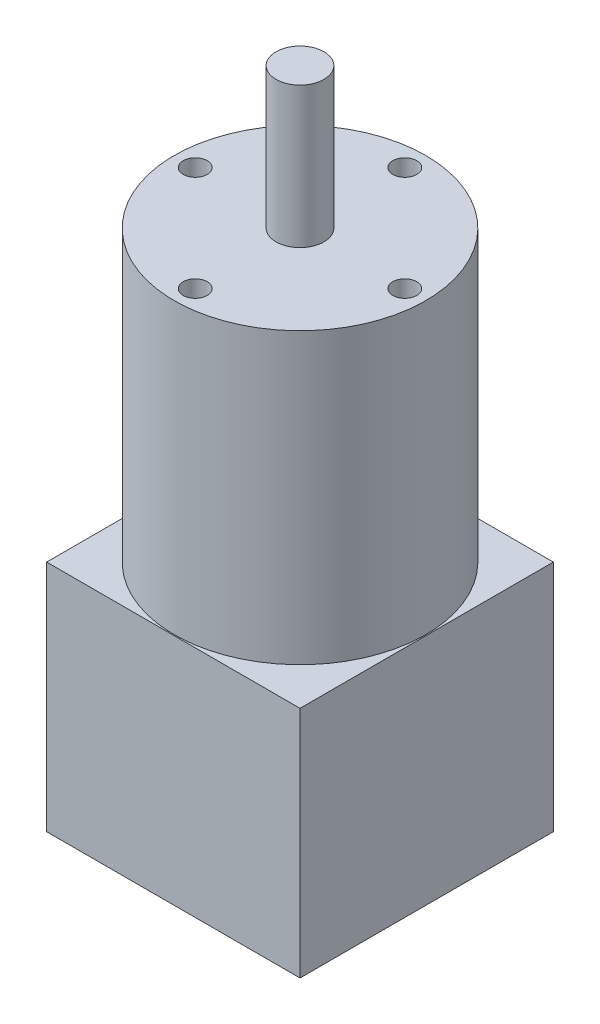
ISO-10303-21;
HEADER;
FILE_DESCRIPTION(('STEP AP214'),'2;1');
FILE_NAME('part.step','',(''),(''),'','','');
FILE_SCHEMA(('AUTOMOTIVE_DESIGN { 1 0 10303 214 1 1 1 1 }'));
ENDSEC;
DATA;
#1=APPLICATION_CONTEXT('core data for automotive mechanical design processes');
#2=APPLICATION_PROTOCOL_DEFINITION('international standard','automotive_design',2000,#1);
#3=PRODUCT_CONTEXT('',#1,'mechanical');
#4=PRODUCT('Part','Part','',(#3));
#5=PRODUCT_RELATED_PRODUCT_CATEGORY('part','',(#4));
#6=PRODUCT_DEFINITION_FORMATION('','',#4);
#7=PRODUCT_DEFINITION_CONTEXT('part definition',#1,'design');
#8=PRODUCT_DEFINITION('design','',#6,#7);
#9=PRODUCT_DEFINITION_SHAPE('','',#8);
#10=(LENGTH_UNIT() NAMED_UNIT(*) SI_UNIT(.MILLI.,.METRE.));
#11=(NAMED_UNIT(*) PLANE_ANGLE_UNIT() SI_UNIT($,.RADIAN.));
#12=(NAMED_UNIT(*) SI_UNIT($,.STERADIAN.) SOLID_ANGLE_UNIT());
#13=UNCERTAINTY_MEASURE_WITH_UNIT(LENGTH_MEASURE(1.E-05),#10,'distance_accuracy_value','');
#14=(GEOMETRIC_REPRESENTATION_CONTEXT(3) GLOBAL_UNCERTAINTY_ASSIGNED_CONTEXT((#13)) GLOBAL_UNIT_ASSIGNED_CONTEXT((#10,
#11,#12)) REPRESENTATION_CONTEXT('',''));
#15=CARTESIAN_POINT('',(0.,0.,0.));
#16=DIRECTION('',(0.,0.,1.));
#17=DIRECTION('',(1.,0.,0.));
#18=AXIS2_PLACEMENT_3D('',#15,#16,#17);
#19=CARTESIAN_POINT('',(0.,110.8,0.));
#20=DIRECTION('',(0.,-1.,0.));
#21=DIRECTION('',(0.,0.,-1.));
#22=AXIS2_PLACEMENT_3D('',#19,#20,#21);
#23=CYLINDRICAL_SURFACE('',#22,4.);
#24=CARTESIAN_POINT('',(0.,87.3,0.));
#25=DIRECTION('',(0.,1.,0.));
#26=DIRECTION('',(0.,0.,1.));
#27=AXIS2_PLACEMENT_3D('',#24,#25,#26);
#28=CIRCLE('',#27,4.);
#29=CARTESIAN_POINT('',(0.,87.3,4.));
#30=VERTEX_POINT('',#29);
#31=EDGE_CURVE('E142',#30,#30,#28,.T.);
#32=ORIENTED_EDGE('',*,*,#31,.T.);
#33=EDGE_LOOP('',(#32));
#34=FACE_BOUND('',#33,.T.);
#35=CARTESIAN_POINT('',(0.,110.8,0.));
#36=DIRECTION('',(0.,1.,0.));
#37=DIRECTION('',(0.,0.,1.));
#38=AXIS2_PLACEMENT_3D('',#35,#36,#37);
#39=CIRCLE('',#38,4.);
#40=CARTESIAN_POINT('',(0.,110.8,4.));
#41=VERTEX_POINT('',#40);
#42=EDGE_CURVE('E254',#41,#41,#39,.T.);
#43=ORIENTED_EDGE('',*,*,#42,.F.);
#44=EDGE_LOOP('',(#43));
#45=FACE_BOUND('',#44,.T.);
#46=DIRECTION('',(0.,-1.,0.));
#47=VECTOR('',#46,1.);
#48=CARTESIAN_POINT('',(-1.5,110.8,-3.70809924354783));
#49=LINE('',#48,#47);
#50=CARTESIAN_POINT('',(-1.5,106.7,-3.70809924354783));
#51=VERTEX_POINT('',#50);
#52=CARTESIAN_POINT('',(-1.5,95.7,-3.70809924354783));
#53=VERTEX_POINT('',#52);
#54=EDGE_CURVE('E148',#51,#53,#49,.T.);
#55=ORIENTED_EDGE('',*,*,#54,.T.);
#56=CARTESIAN_POINT('',(-1.5,95.7,-3.70809924354783));
#57=CARTESIAN_POINT('',(-1.50000149763685,95.6594059305553,-3.70809443488223));
#58=CARTESIAN_POINT('',(-1.49835105709717,95.6188329978994,-3.70876668409976));
#59=CARTESIAN_POINT('',(-1.49177843163966,95.5380093568391,-3.71141698257091));
#60=CARTESIAN_POINT('',(-1.48685734569824,95.4977585447944,-3.71339459320577));
#61=CARTESIAN_POINT('',(-1.4672933482067,95.378226826317,-3.72119033682707));
#62=CARTESIAN_POINT('',(-1.44784901310297,95.2997974497691,-3.72887225208868));
#63=CARTESIAN_POINT('',(-1.39690282812453,95.1476339471668,-3.74825199333564));
#64=CARTESIAN_POINT('',(-1.36541091184269,95.0738960111434,-3.75994650999366));
#65=CARTESIAN_POINT('',(-1.29134257885079,94.9326690628724,-3.7860233337759));
#66=CARTESIAN_POINT('',(-1.24875666733342,94.8651854708132,-3.80040794022651));
#67=CARTESIAN_POINT('',(-1.15146673631305,94.7351088724607,-3.83103570457934));
#68=CARTESIAN_POINT('',(-1.0963044481655,94.6728715264412,-3.84733331324471));
#69=CARTESIAN_POINT('',(-0.976395613097517,94.5582775205832,-3.87949750401636));
#70=CARTESIAN_POINT('',(-0.911646994469719,94.505923002106,-3.89536399207354));
#71=CARTESIAN_POINT('',(-0.771671110191602,94.4108435774906,-3.92553400925355));
#72=CARTESIAN_POINT('',(-0.696160035999181,94.3685118052143,-3.93976501267995));
#73=CARTESIAN_POINT('',(-0.538489868027633,94.2973265968158,-3.9643883038365));
#74=CARTESIAN_POINT('',(-0.456337903183924,94.2684589267464,-3.97478464304361));
#75=CARTESIAN_POINT('',(-0.311568360413163,94.2313833692295,-3.98831063781509));
#76=CARTESIAN_POINT('',(-0.249946259701632,94.2196498632232,-3.9926612104967));
#77=CARTESIAN_POINT('',(-0.125564806183786,94.2039443418765,-3.99852089820637));
#78=CARTESIAN_POINT('',(-0.062804988216711,94.1999755768709,-4.00002882328734));
#79=CARTESIAN_POINT('',(0.,94.2,-4.));
#80=B_SPLINE_CURVE_WITH_KNOTS('',3,(#56,#57,#58,#59,#60,#61,#62,#63,#64,#65,#66,#67,#68,#69,#70,
#71,#72,#73,#74,#75,#76,#77,#78,#79),.UNSPECIFIED.,.F.,.F.,(4,2,2,2,2,2,2,2,2,2,2,4),(0.,
0.121702070650527,0.243363268593937,0.485593089370354,0.727623613350272,0.969861963846899,
1.22297737762719,1.47614757238601,1.73802530937246,1.9996255640306,2.18773738057225,
2.37592792422954),.UNSPECIFIED.);
#81=CARTESIAN_POINT('',(0.,94.2,-4.));
#82=VERTEX_POINT('',#81);
#83=EDGE_CURVE('E59',#53,#82,#80,.T.);
#84=ORIENTED_EDGE('',*,*,#83,.T.);
#85=CARTESIAN_POINT('',(0.,94.2,-4.));
#86=CARTESIAN_POINT('',(0.0406958829842187,94.1999987715417,-4.0000033265242));
#87=CARTESIAN_POINT('',(0.0813709954107094,94.2016572436765,-3.99937821643425));
#88=CARTESIAN_POINT('',(0.162404982142699,94.2082636148125,-3.99690675065887));
#89=CARTESIAN_POINT('',(0.202763939083229,94.2132106231327,-3.99506072565186));
#90=CARTESIAN_POINT('',(0.322658818153228,94.2328868689112,-3.98776419542613));
#91=CARTESIAN_POINT('',(0.401351138250184,94.2524519115586,-3.98055464040178));
#92=CARTESIAN_POINT('',(0.554057247937605,94.3037487278131,-3.96219014943225));
#93=CARTESIAN_POINT('',(0.628073544622783,94.3354739160358,-3.9510373492233));
#94=CARTESIAN_POINT('',(0.769768846215137,94.4100889205701,-3.92589331480545));
#95=CARTESIAN_POINT('',(0.837443568408158,94.4529862089937,-3.91190018231573));
#96=CARTESIAN_POINT('',(0.967344906860734,94.5506106720114,-3.88186303805133));
#97=CARTESIAN_POINT('',(1.02926635746347,94.605725774499,-3.86576126025821));
#98=CARTESIAN_POINT('',(1.14324026520414,94.7254061833371,-3.83360332452306));
#99=CARTESIAN_POINT('',(1.19528897996651,94.7899750568822,-3.8175471861438));
#100=CARTESIAN_POINT('',(1.2900021675008,94.9297458027432,-3.78661824913521));
#101=CARTESIAN_POINT('',(1.3322282773455,95.005261304648,-3.77181479391607));
#102=CARTESIAN_POINT('',(1.40321260233322,95.1629257096992,-3.74598828763862));
#103=CARTESIAN_POINT('',(1.43198755826084,95.2450662174501,-3.73496054207913));
#104=CARTESIAN_POINT('',(1.4688507799066,95.3895938732747,-3.72058587751727));
#105=CARTESIAN_POINT('',(1.4804930770667,95.450966567495,-3.71594709538589));
#106=CARTESIAN_POINT('',(1.49608314541372,95.5748756822457,-3.70968378110959));
#107=CARTESIAN_POINT('',(1.50002515651037,95.6374129386371,-3.70806150546337));
#108=CARTESIAN_POINT('',(1.5,95.7,-3.70809924354783));
#109=B_SPLINE_CURVE_WITH_KNOTS('',3,(#85,#86,#87,#88,#89,#90,#91,#92,#93,#94,#95,#96,#97,#98,
#99,#100,#101,#102,#103,#104,#105,#106,#107,#108),.UNSPECIFIED.,.F.,.F.,(4,2,2,2,2,2,2,2,2,2,2,
4),(0.,0.122008525653371,0.243984019459629,0.486933412549048,0.729751420715084,
0.972732249088057,1.2249558748475,1.47727491867927,1.73930674597636,2.0010115846268,
2.18839922255605,2.37592697956525),.UNSPECIFIED.);
#110=CARTESIAN_POINT('',(1.5,95.7,-3.70809924354783));
#111=VERTEX_POINT('',#110);
#112=EDGE_CURVE('E170',#82,#111,#109,.T.);
#113=ORIENTED_EDGE('',*,*,#112,.T.);
#114=DIRECTION('',(0.,-1.,0.));
#115=VECTOR('',#114,1.);
#116=CARTESIAN_POINT('',(1.5,110.8,-3.70809924354783));
#117=LINE('',#116,#115);
#118=CARTESIAN_POINT('',(1.5,106.7,-3.70809924354783));
#119=VERTEX_POINT('',#118);
#120=EDGE_CURVE('E150',#111,#119,#117,.F.);
#121=ORIENTED_EDGE('',*,*,#120,.T.);
#122=CARTESIAN_POINT('',(1.5,106.7,-3.70809924354783));
#123=CARTESIAN_POINT('',(1.50000149763685,106.740594069445,-3.70809443488223));
#124=CARTESIAN_POINT('',(1.49835105709716,106.781167002101,-3.70876668409977));
#125=CARTESIAN_POINT('',(1.49177843163965,106.861990643161,-3.71141698257091));
#126=CARTESIAN_POINT('',(1.48685734569824,106.902241455206,-3.71339459320577));
#127=CARTESIAN_POINT('',(1.4672933482067,107.021773173683,-3.72119033682707));
#128=CARTESIAN_POINT('',(1.44784901310297,107.100202550231,-3.72887225208868));
#129=CARTESIAN_POINT('',(1.39690282812453,107.252366052833,-3.74825199333564));
#130=CARTESIAN_POINT('',(1.3654109118427,107.326103988857,-3.75994650999366));
#131=CARTESIAN_POINT('',(1.29134257885079,107.467330937128,-3.7860233337759));
#132=CARTESIAN_POINT('',(1.24875666733342,107.534814529187,-3.80040794022651));
#133=CARTESIAN_POINT('',(1.15146673631305,107.664891127539,-3.83103570457934));
#134=CARTESIAN_POINT('',(1.09630444816551,107.727128473559,-3.84733331324471));
#135=CARTESIAN_POINT('',(0.976395613097518,107.841722479417,-3.87949750401636));
#136=CARTESIAN_POINT('',(0.911646994469717,107.894076997894,-3.89536399207354));
#137=CARTESIAN_POINT('',(0.771671110191596,107.989156422509,-3.92553400925355));
#138=CARTESIAN_POINT('',(0.696160035999174,108.031488194786,-3.93976501267995));
#139=CARTESIAN_POINT('',(0.538489868027627,108.102673403184,-3.9643883038365));
#140=CARTESIAN_POINT('',(0.456337903183921,108.131541073254,-3.97478464304361));
#141=CARTESIAN_POINT('',(0.311568360413164,108.16861663077,-3.98831063781509));
#142=CARTESIAN_POINT('',(0.249946259701633,108.180350136777,-3.9926612104967));
#143=CARTESIAN_POINT('',(0.125564806183786,108.196055658123,-3.99852089820637));
#144=CARTESIAN_POINT('',(0.0628049882167101,108.200024423129,-4.00002882328734));
#145=CARTESIAN_POINT('',(0.,108.2,-4.));
#146=B_SPLINE_CURVE_WITH_KNOTS('',3,(#122,#123,#124,#125,#126,#127,#128,#129,#130,#131,#132,
#133,#134,#135,#136,#137,#138,#139,#140,#141,#142,#143,#144,#145),.UNSPECIFIED.,.F.,.F.,(4,2,2,
2,2,2,2,2,2,2,2,4),(0.,0.12170207065054,0.243363268593951,0.485593089370354,0.727623613350272,
0.969861963846899,1.2229773776272,1.47614757238601,1.73802530937248,1.9996255640306,
2.18773738057225,2.37592792422954),.UNSPECIFIED.);
#147=CARTESIAN_POINT('',(0.,108.2,-4.));
#148=VERTEX_POINT('',#147);
#149=EDGE_CURVE('E46',#119,#148,#146,.T.);
#150=ORIENTED_EDGE('',*,*,#149,.T.);
#151=CARTESIAN_POINT('',(0.,108.2,-4.));
#152=CARTESIAN_POINT('',(-0.0406958829842185,108.200001228458,-4.0000033265242));
#153=CARTESIAN_POINT('',(-0.0813709954107083,108.198342756323,-3.99937821643425));
#154=CARTESIAN_POINT('',(-0.162404982142698,108.191736385187,-3.99690675065887));
#155=CARTESIAN_POINT('',(-0.202763939083227,108.186789376867,-3.99506072565186));
#156=CARTESIAN_POINT('',(-0.322658818153227,108.167113131089,-3.98776419542613));
#157=CARTESIAN_POINT('',(-0.401351138250184,108.147548088441,-3.98055464040178));
#158=CARTESIAN_POINT('',(-0.554057247937611,108.096251272187,-3.96219014943225));
#159=CARTESIAN_POINT('',(-0.628073544622794,108.064526083964,-3.9510373492233));
#160=CARTESIAN_POINT('',(-0.769768846215147,107.98991107943,-3.92589331480545));
#161=CARTESIAN_POINT('',(-0.837443568408163,107.947013791006,-3.91190018231573));
#162=CARTESIAN_POINT('',(-0.967344906860735,107.849389327989,-3.88186303805133));
#163=CARTESIAN_POINT('',(-1.02926635746348,107.794274225501,-3.86576126025821));
#164=CARTESIAN_POINT('',(-1.14324026520414,107.674593816663,-3.83360332452306));
#165=CARTESIAN_POINT('',(-1.19528897996651,107.610024943118,-3.8175471861438));
#166=CARTESIAN_POINT('',(-1.2900021675008,107.470254197257,-3.78661824913521));
#167=CARTESIAN_POINT('',(-1.3322282773455,107.394738695352,-3.77181479391607));
#168=CARTESIAN_POINT('',(-1.40321260233322,107.237074290301,-3.74598828763861));
#169=CARTESIAN_POINT('',(-1.43198755826084,107.15493378255,-3.73496054207913));
#170=CARTESIAN_POINT('',(-1.4688507799066,107.010406126725,-3.72058587751726));
#171=CARTESIAN_POINT('',(-1.4804930770667,106.949033432505,-3.71594709538589));
#172=CARTESIAN_POINT('',(-1.49608314541372,106.825124317754,-3.7096837811096));
#173=CARTESIAN_POINT('',(-1.50002515651037,106.762587061363,-3.70806150546337));
#174=CARTESIAN_POINT('',(-1.5,106.7,-3.70809924354783));
#175=B_SPLINE_CURVE_WITH_KNOTS('',3,(#151,#152,#153,#154,#155,#156,#157,#158,#159,#160,#161,
#162,#163,#164,#165,#166,#167,#168,#169,#170,#171,#172,#173,#174),.UNSPECIFIED.,.F.,.F.,(4,2,2,
2,2,2,2,2,2,2,2,4),(0.,0.122008525653369,0.243984019459627,0.486933412549048,0.729751420715105,
0.972732249088057,1.2249558748475,1.47727491867927,1.73930674597636,2.0010115846268,
2.18839922255604,2.37592697956525),.UNSPECIFIED.);
#176=EDGE_CURVE('E11',#148,#51,#175,.T.);
#177=ORIENTED_EDGE('',*,*,#176,.T.);
#178=EDGE_LOOP('',(#55,#84,#113,#121,#150,#177));
#179=FACE_BOUND('',#178,.T.);
#180=ADVANCED_FACE('F36',(#34,#45,#179),#23,.T.);
#181=CARTESIAN_POINT('',(21.15,39.,21.15));
#182=DIRECTION('',(-1.,0.,0.));
#183=DIRECTION('',(0.,0.,1.));
#184=AXIS2_PLACEMENT_3D('',#181,#182,#183);
#185=PLANE('',#184);
#186=DIRECTION('',(0.,0.,-1.));
#187=VECTOR('',#186,1.);
#188=CARTESIAN_POINT('',(21.15,0.,21.15));
#189=LINE('',#188,#187);
#190=CARTESIAN_POINT('',(21.15,0.,21.15));
#191=VERTEX_POINT('',#190);
#192=CARTESIAN_POINT('',(21.15,0.,-21.15));
#193=VERTEX_POINT('',#192);
#194=EDGE_CURVE('E138',#191,#193,#189,.T.);
#195=ORIENTED_EDGE('',*,*,#194,.T.);
#196=DIRECTION('',(0.,-1.,0.));
#197=VECTOR('',#196,1.);
#198=CARTESIAN_POINT('',(21.15,39.,-21.15));
#199=LINE('',#198,#197);
#200=CARTESIAN_POINT('',(21.15,39.,-21.15));
#201=VERTEX_POINT('',#200);
#202=EDGE_CURVE('E118',#201,#193,#199,.T.);
#203=ORIENTED_EDGE('',*,*,#202,.F.);
#204=DIRECTION('',(0.,0.,-1.));
#205=VECTOR('',#204,1.);
#206=CARTESIAN_POINT('',(21.15,39.,21.15));
#207=LINE('',#206,#205);
#208=CARTESIAN_POINT('',(21.15,39.,21.15));
#209=VERTEX_POINT('',#208);
#210=EDGE_CURVE('E125',#209,#201,#207,.T.);
#211=ORIENTED_EDGE('',*,*,#210,.F.);
#212=DIRECTION('',(0.,-1.,0.));
#213=VECTOR('',#212,1.);
#214=CARTESIAN_POINT('',(21.15,39.,21.15));
#215=LINE('',#214,#213);
#216=EDGE_CURVE('E266',#209,#191,#215,.T.);
#217=ORIENTED_EDGE('',*,*,#216,.T.);
#218=EDGE_LOOP('',(#195,#203,#211,#217));
#219=FACE_BOUND('',#218,.T.);
#220=ADVANCED_FACE('F136',(#219),#185,.F.);
#221=CARTESIAN_POINT('',(-21.15,39.,-21.15));
#222=DIRECTION('',(0.,0.,1.));
#223=DIRECTION('',(1.,0.,0.));
#224=AXIS2_PLACEMENT_3D('',#221,#222,#223);
#225=PLANE('',#224);
#226=DIRECTION('',(-1.,0.,0.));
#227=VECTOR('',#226,1.);
#228=CARTESIAN_POINT('',(-21.15,0.,-21.15));
#229=LINE('',#228,#227);
#230=CARTESIAN_POINT('',(-21.15,0.,-21.15));
#231=VERTEX_POINT('',#230);
#232=EDGE_CURVE('E268',#193,#231,#229,.T.);
#233=ORIENTED_EDGE('',*,*,#232,.T.);
#234=DIRECTION('',(0.,-1.,0.));
#235=VECTOR('',#234,1.);
#236=CARTESIAN_POINT('',(-21.15,39.,-21.15));
#237=LINE('',#236,#235);
#238=CARTESIAN_POINT('',(-21.15,39.,-21.15));
#239=VERTEX_POINT('',#238);
#240=EDGE_CURVE('E121',#239,#231,#237,.T.);
#241=ORIENTED_EDGE('',*,*,#240,.F.);
#242=DIRECTION('',(-1.,0.,0.));
#243=VECTOR('',#242,1.);
#244=CARTESIAN_POINT('',(-21.15,39.,-21.15));
#245=LINE('',#244,#243);
#246=EDGE_CURVE('E114',#201,#239,#245,.T.);
#247=ORIENTED_EDGE('',*,*,#246,.F.);
#248=ORIENTED_EDGE('',*,*,#202,.T.);
#249=EDGE_LOOP('',(#233,#241,#247,#248));
#250=FACE_BOUND('',#249,.T.);
#251=ADVANCED_FACE('F116',(#250),#225,.F.);
#252=CARTESIAN_POINT('',(-21.15,39.,21.15));
#253=DIRECTION('',(1.,0.,0.));
#254=DIRECTION('',(0.,0.,-1.));
#255=AXIS2_PLACEMENT_3D('',#252,#253,#254);
#256=PLANE('',#255);
#257=DIRECTION('',(0.,0.,1.));
#258=VECTOR('',#257,1.);
#259=CARTESIAN_POINT('',(-21.15,0.,21.15));
#260=LINE('',#259,#258);
#261=CARTESIAN_POINT('',(-21.15,0.,21.15));
#262=VERTEX_POINT('',#261);
#263=EDGE_CURVE('E270',#231,#262,#260,.T.);
#264=ORIENTED_EDGE('',*,*,#263,.T.);
#265=DIRECTION('',(0.,-1.,0.));
#266=VECTOR('',#265,1.);
#267=CARTESIAN_POINT('',(-21.15,39.,21.15));
#268=LINE('',#267,#266);
#269=CARTESIAN_POINT('',(-21.15,39.,21.15));
#270=VERTEX_POINT('',#269);
#271=EDGE_CURVE('E144',#270,#262,#268,.T.);
#272=ORIENTED_EDGE('',*,*,#271,.F.);
#273=DIRECTION('',(0.,0.,1.));
#274=VECTOR('',#273,1.);
#275=CARTESIAN_POINT('',(-21.15,39.,21.15));
#276=LINE('',#275,#274);
#277=EDGE_CURVE('E124',#239,#270,#276,.T.);
#278=ORIENTED_EDGE('',*,*,#277,.F.);
#279=ORIENTED_EDGE('',*,*,#240,.T.);
#280=EDGE_LOOP('',(#264,#272,#278,#279));
#281=FACE_BOUND('',#280,.T.);
#282=ADVANCED_FACE('F282',(#281),#256,.F.);
#283=CARTESIAN_POINT('',(-21.15,39.,21.15));
#284=DIRECTION('',(0.,0.,-1.));
#285=DIRECTION('',(-1.,0.,0.));
#286=AXIS2_PLACEMENT_3D('',#283,#284,#285);
#287=PLANE('',#286);
#288=DIRECTION('',(1.,0.,0.));
#289=VECTOR('',#288,1.);
#290=CARTESIAN_POINT('',(-21.15,0.,21.15));
#291=LINE('',#290,#289);
#292=EDGE_CURVE('E134',#262,#191,#291,.T.);
#293=ORIENTED_EDGE('',*,*,#292,.T.);
#294=ORIENTED_EDGE('',*,*,#216,.F.);
#295=DIRECTION('',(1.,0.,0.));
#296=VECTOR('',#295,1.);
#297=CARTESIAN_POINT('',(-21.15,39.,21.15));
#298=LINE('',#297,#296);
#299=EDGE_CURVE('E130',#270,#209,#298,.T.);
#300=ORIENTED_EDGE('',*,*,#299,.F.);
#301=ORIENTED_EDGE('',*,*,#271,.T.);
#302=EDGE_LOOP('',(#293,#294,#300,#301));
#303=FACE_BOUND('',#302,.T.);
#304=ADVANCED_FACE('F277',(#303),#287,.F.);
#305=CARTESIAN_POINT('',(0.,39.,0.));
#306=DIRECTION('',(0.,-1.,0.));
#307=DIRECTION('',(0.,0.,-1.));
#308=AXIS2_PLACEMENT_3D('',#305,#306,#307);
#309=PLANE('',#308);
#310=CARTESIAN_POINT('',(0.,39.,0.));
#311=DIRECTION('',(0.,1.,0.));
#312=DIRECTION('',(0.,0.,1.));
#313=AXIS2_PLACEMENT_3D('',#310,#311,#312);
#314=CIRCLE('',#313,21.);
#315=CARTESIAN_POINT('',(0.,39.,-21.));
#316=VERTEX_POINT('',#315);
#317=EDGE_CURVE('E139',#316,#316,#314,.T.);
#318=ORIENTED_EDGE('',*,*,#317,.F.);
#319=EDGE_LOOP('',(#318));
#320=FACE_BOUND('',#319,.T.);
#321=ORIENTED_EDGE('',*,*,#210,.T.);
#322=ORIENTED_EDGE('',*,*,#246,.T.);
#323=ORIENTED_EDGE('',*,*,#277,.T.);
#324=ORIENTED_EDGE('',*,*,#299,.T.);
#325=EDGE_LOOP('',(#321,#322,#323,#324));
#326=FACE_BOUND('',#325,.T.);
#327=ADVANCED_FACE('F128',(#320,#326),#309,.F.);
#328=CARTESIAN_POINT('',(0.,0.,0.));
#329=DIRECTION('',(0.,-1.,0.));
#330=DIRECTION('',(0.,0.,-1.));
#331=AXIS2_PLACEMENT_3D('',#328,#329,#330);
#332=PLANE('',#331);
#333=CARTESIAN_POINT('',(0.,0.,0.));
#334=DIRECTION('',(0.,-1.,0.));
#335=DIRECTION('',(0.,0.,-1.));
#336=AXIS2_PLACEMENT_3D('',#333,#334,#335);
#337=CIRCLE('',#336,2.5);
#338=CARTESIAN_POINT('',(0.,0.,-2.5));
#339=VERTEX_POINT('',#338);
#340=EDGE_CURVE('E249',#339,#339,#337,.T.);
#341=ORIENTED_EDGE('',*,*,#340,.F.);
#342=EDGE_LOOP('',(#341));
#343=FACE_BOUND('',#342,.T.);
#344=ORIENTED_EDGE('',*,*,#194,.F.);
#345=ORIENTED_EDGE('',*,*,#292,.F.);
#346=ORIENTED_EDGE('',*,*,#263,.F.);
#347=ORIENTED_EDGE('',*,*,#232,.F.);
#348=EDGE_LOOP('',(#344,#345,#346,#347));
#349=FACE_BOUND('',#348,.T.);
#350=ADVANCED_FACE('F281',(#343,#349),#332,.T.);
#351=CARTESIAN_POINT('',(0.,87.3,0.));
#352=DIRECTION('',(0.,-1.,0.));
#353=DIRECTION('',(0.,0.,-1.));
#354=AXIS2_PLACEMENT_3D('',#351,#352,#353);
#355=CYLINDRICAL_SURFACE('',#354,21.);
#356=CARTESIAN_POINT('',(0.,87.3,0.));
#357=DIRECTION('',(0.,1.,0.));
#358=DIRECTION('',(0.,0.,1.));
#359=AXIS2_PLACEMENT_3D('',#356,#357,#358);
#360=CIRCLE('',#359,21.);
#361=CARTESIAN_POINT('',(0.,87.3,-21.));
#362=VERTEX_POINT('',#361);
#363=EDGE_CURVE('E259',#362,#362,#360,.T.);
#364=CARTESIAN_POINT('',(0.,87.3,-21.));
#365=CARTESIAN_POINT('',(0.,86.796875,-21.));
#366=CARTESIAN_POINT('',(0.,86.29375,-21.));
#367=CARTESIAN_POINT('',(0.,85.2875,-21.));
#368=CARTESIAN_POINT('',(0.,84.784375,-21.));
#369=CARTESIAN_POINT('',(0.,83.778125,-21.));
#370=CARTESIAN_POINT('',(0.,83.275,-21.));
#371=CARTESIAN_POINT('',(0.,82.26875,-21.));
#372=CARTESIAN_POINT('',(0.,81.765625,-21.));
#373=CARTESIAN_POINT('',(0.,80.759375,-21.));
#374=CARTESIAN_POINT('',(0.,80.25625,-21.));
#375=CARTESIAN_POINT('',(0.,79.25,-21.));
#376=CARTESIAN_POINT('',(0.,78.746875,-21.));
#377=CARTESIAN_POINT('',(0.,77.740625,-21.));
#378=CARTESIAN_POINT('',(0.,77.2375,-21.));
#379=CARTESIAN_POINT('',(0.,76.23125,-21.));
#380=CARTESIAN_POINT('',(0.,75.728125,-21.));
#381=CARTESIAN_POINT('',(0.,74.721875,-21.));
#382=CARTESIAN_POINT('',(0.,74.21875,-21.));
#383=CARTESIAN_POINT('',(0.,73.2125,-21.));
#384=CARTESIAN_POINT('',(0.,72.709375,-21.));
#385=CARTESIAN_POINT('',(0.,71.703125,-21.));
#386=CARTESIAN_POINT('',(0.,71.2,-21.));
#387=CARTESIAN_POINT('',(0.,70.19375,-21.));
#388=CARTESIAN_POINT('',(0.,69.690625,-21.));
#389=CARTESIAN_POINT('',(0.,68.684375,-21.));
#390=CARTESIAN_POINT('',(0.,68.18125,-21.));
#391=CARTESIAN_POINT('',(0.,67.175,-21.));
#392=CARTESIAN_POINT('',(0.,66.671875,-21.));
#393=CARTESIAN_POINT('',(0.,65.665625,-21.));
#394=CARTESIAN_POINT('',(0.,65.1625,-21.));
#395=CARTESIAN_POINT('',(0.,64.15625,-21.));
#396=CARTESIAN_POINT('',(0.,63.653125,-21.));
#397=CARTESIAN_POINT('',(0.,62.646875,-21.));
#398=CARTESIAN_POINT('',(0.,62.14375,-21.));
#399=CARTESIAN_POINT('',(0.,61.1375,-21.));
#400=CARTESIAN_POINT('',(0.,60.634375,-21.));
#401=CARTESIAN_POINT('',(0.,59.628125,-21.));
#402=CARTESIAN_POINT('',(0.,59.125,-21.));
#403=CARTESIAN_POINT('',(0.,58.11875,-21.));
#404=CARTESIAN_POINT('',(0.,57.615625,-21.));
#405=CARTESIAN_POINT('',(0.,56.609375,-21.));
#406=CARTESIAN_POINT('',(0.,56.10625,-21.));
#407=CARTESIAN_POINT('',(0.,55.1,-21.));
#408=CARTESIAN_POINT('',(0.,54.596875,-21.));
#409=CARTESIAN_POINT('',(0.,53.590625,-21.));
#410=CARTESIAN_POINT('',(0.,53.0875,-21.));
#411=CARTESIAN_POINT('',(0.,52.08125,-21.));
#412=CARTESIAN_POINT('',(0.,51.578125,-21.));
#413=CARTESIAN_POINT('',(0.,50.571875,-21.));
#414=CARTESIAN_POINT('',(0.,50.06875,-21.));
#415=CARTESIAN_POINT('',(0.,49.0625,-21.));
#416=CARTESIAN_POINT('',(0.,48.559375,-21.));
#417=CARTESIAN_POINT('',(0.,47.553125,-21.));
#418=CARTESIAN_POINT('',(0.,47.05,-21.));
#419=CARTESIAN_POINT('',(0.,46.04375,-21.));
#420=CARTESIAN_POINT('',(0.,45.540625,-21.));
#421=CARTESIAN_POINT('',(0.,44.534375,-21.));
#422=CARTESIAN_POINT('',(0.,44.03125,-21.));
#423=CARTESIAN_POINT('',(0.,43.025,-21.));
#424=CARTESIAN_POINT('',(0.,42.521875,-21.));
#425=CARTESIAN_POINT('',(0.,41.515625,-21.));
#426=CARTESIAN_POINT('',(0.,41.0125,-21.));
#427=CARTESIAN_POINT('',(0.,40.00625,-21.));
#428=CARTESIAN_POINT('',(0.,39.503125,-21.));
#429=CARTESIAN_POINT('',(0.,39.,-21.));
#430=B_SPLINE_CURVE_WITH_KNOTS('',3,(#364,#365,#366,#367,#368,#369,#370,#371,#372,#373,#374,
#375,#376,#377,#378,#379,#380,#381,#382,#383,#384,#385,#386,#387,#388,#389,#390,#391,#392,#393,
#394,#395,#396,#397,#398,#399,#400,#401,#402,#403,#404,#405,#406,#407,#408,#409,#410,#411,#412,
#413,#414,#415,#416,#417,#418,#419,#420,#421,#422,#423,#424,#425,#426,#427,#428,#429),
.UNSPECIFIED.,.F.,.F.,(4,2,2,2,2,2,2,2,2,2,2,2,2,2,2,2,2,2,2,2,2,2,2,2,2,2,2,2,2,2,2,2,4),(0.,
1.50937500000001,3.01875,4.52812500000001,6.0375,7.54687500000001,9.05625,10.565625,12.075,
13.584375,15.09375,16.603125,18.1125,19.621875,21.13125,22.640625,24.15,25.659375,27.16875,
28.678125,30.1875,31.696875,33.20625,34.715625,36.225,37.734375,39.24375,40.753125,42.2625,
43.771875,45.28125,46.790625,48.3),.UNSPECIFIED.);
#431=EDGE_CURVE('BSEAM338',#362,#316,#430,.T.);
#432=ORIENTED_EDGE('',*,*,#363,.F.);
#433=ORIENTED_EDGE('',*,*,#317,.T.);
#434=ORIENTED_EDGE('',*,*,#431,.T.);
#435=ORIENTED_EDGE('',*,*,#431,.F.);
#436=EDGE_LOOP('',(#432,#434,#433,#435));
#437=FACE_BOUND('',#436,.T.);
#438=ADVANCED_FACE('F338',(#437),#355,.T.);
#439=CARTESIAN_POINT('',(0.,87.3,0.));
#440=DIRECTION('',(0.,1.,0.));
#441=DIRECTION('',(0.,0.,1.));
#442=AXIS2_PLACEMENT_3D('',#439,#440,#441);
#443=PLANE('',#442);
#444=CARTESIAN_POINT('',(0.,87.3,-17.5));
#445=DIRECTION('',(0.,1.,0.));
#446=DIRECTION('',(0.,0.,1.));
#447=AXIS2_PLACEMENT_3D('',#444,#445,#446);
#448=CIRCLE('',#447,2.);
#449=CARTESIAN_POINT('',(0.,87.3,-15.5));
#450=VERTEX_POINT('',#449);
#451=EDGE_CURVE('E223',#450,#450,#448,.T.);
#452=ORIENTED_EDGE('',*,*,#451,.F.);
#453=EDGE_LOOP('',(#452));
#454=FACE_BOUND('',#453,.T.);
#455=CARTESIAN_POINT('',(17.5,87.3,0.));
#456=DIRECTION('',(0.,1.,0.));
#457=DIRECTION('',(0.,0.,1.));
#458=AXIS2_PLACEMENT_3D('',#455,#456,#457);
#459=CIRCLE('',#458,2.);
#460=CARTESIAN_POINT('',(17.5,87.3,2.));
#461=VERTEX_POINT('',#460);
#462=EDGE_CURVE('E233',#461,#461,#459,.T.);
#463=ORIENTED_EDGE('',*,*,#462,.F.);
#464=EDGE_LOOP('',(#463));
#465=FACE_BOUND('',#464,.T.);
#466=CARTESIAN_POINT('',(0.,87.3,17.5));
#467=DIRECTION('',(0.,1.,0.));
#468=DIRECTION('',(0.,0.,1.));
#469=AXIS2_PLACEMENT_3D('',#466,#467,#468);
#470=CIRCLE('',#469,2.);
#471=CARTESIAN_POINT('',(0.,87.3,19.5));
#472=VERTEX_POINT('',#471);
#473=EDGE_CURVE('E239',#472,#472,#470,.T.);
#474=ORIENTED_EDGE('',*,*,#473,.F.);
#475=EDGE_LOOP('',(#474));
#476=FACE_BOUND('',#475,.T.);
#477=CARTESIAN_POINT('',(-17.5,87.3,0.));
#478=DIRECTION('',(0.,1.,0.));
#479=DIRECTION('',(0.,0.,1.));
#480=AXIS2_PLACEMENT_3D('',#477,#478,#479);
#481=CIRCLE('',#480,2.);
#482=CARTESIAN_POINT('',(-17.5,87.3,2.));
#483=VERTEX_POINT('',#482);
#484=EDGE_CURVE('E245',#483,#483,#481,.T.);
#485=ORIENTED_EDGE('',*,*,#484,.F.);
#486=EDGE_LOOP('',(#485));
#487=FACE_BOUND('',#486,.T.);
#488=ORIENTED_EDGE('',*,*,#31,.F.);
#489=EDGE_LOOP('',(#488));
#490=FACE_BOUND('',#489,.T.);
#491=ORIENTED_EDGE('',*,*,#363,.T.);
#492=EDGE_LOOP('',(#491));
#493=FACE_BOUND('',#492,.T.);
#494=ADVANCED_FACE('F333',(#454,#465,#476,#487,#490,#493),#443,.T.);
#495=CARTESIAN_POINT('',(0.,110.8,0.));
#496=DIRECTION('',(0.,1.,0.));
#497=DIRECTION('',(0.,0.,1.));
#498=AXIS2_PLACEMENT_3D('',#495,#496,#497);
#499=PLANE('',#498);
#500=ORIENTED_EDGE('',*,*,#42,.T.);
#501=EDGE_LOOP('',(#500));
#502=FACE_BOUND('',#501,.T.);
#503=ADVANCED_FACE('F330',(#502),#499,.T.);
#504=CARTESIAN_POINT('',(0.,-9.5,0.));
#505=DIRECTION('',(0.,1.,0.));
#506=DIRECTION('',(0.,0.,1.));
#507=AXIS2_PLACEMENT_3D('',#504,#505,#506);
#508=CYLINDRICAL_SURFACE('',#507,2.5);
#509=CARTESIAN_POINT('',(0.,-9.5,0.));
#510=DIRECTION('',(0.,-1.,0.));
#511=DIRECTION('',(0.,0.,-1.));
#512=AXIS2_PLACEMENT_3D('',#509,#510,#511);
#513=CIRCLE('',#512,2.5);
#514=CARTESIAN_POINT('',(0.,-9.5,-2.5));
#515=VERTEX_POINT('',#514);
#516=EDGE_CURVE('E251',#515,#515,#513,.T.);
#517=ORIENTED_EDGE('',*,*,#516,.F.);
#518=EDGE_LOOP('',(#517));
#519=FACE_BOUND('',#518,.T.);
#520=ORIENTED_EDGE('',*,*,#340,.T.);
#521=EDGE_LOOP('',(#520));
#522=FACE_BOUND('',#521,.T.);
#523=ADVANCED_FACE('F327',(#519,#522),#508,.T.);
#524=CARTESIAN_POINT('',(0.,-9.5,0.));
#525=DIRECTION('',(0.,-1.,0.));
#526=DIRECTION('',(0.,0.,-1.));
#527=AXIS2_PLACEMENT_3D('',#524,#525,#526);
#528=PLANE('',#527);
#529=ORIENTED_EDGE('',*,*,#516,.T.);
#530=EDGE_LOOP('',(#529));
#531=FACE_BOUND('',#530,.T.);
#532=ADVANCED_FACE('F321',(#531),#528,.T.);
#533=CARTESIAN_POINT('',(1.5,94.2,-5.2));
#534=DIRECTION('',(1.,0.,0.));
#535=DIRECTION('',(0.,0.,-1.));
#536=AXIS2_PLACEMENT_3D('',#533,#534,#535);
#537=PLANE('',#536);
#538=ORIENTED_EDGE('',*,*,#120,.F.);
#539=DIRECTION('',(0.,0.,-1.));
#540=VECTOR('',#539,1.);
#541=CARTESIAN_POINT('',(1.5,95.7,-5.2));
#542=LINE('',#541,#540);
#543=CARTESIAN_POINT('',(1.5,95.7,-2.2));
#544=VERTEX_POINT('',#543);
#545=EDGE_CURVE('E155',#111,#544,#542,.F.);
#546=ORIENTED_EDGE('',*,*,#545,.T.);
#547=DIRECTION('',(0.,1.,0.));
#548=VECTOR('',#547,1.);
#549=CARTESIAN_POINT('',(1.5,94.2,-2.2));
#550=LINE('',#549,#548);
#551=CARTESIAN_POINT('',(1.5,106.7,-2.2));
#552=VERTEX_POINT('',#551);
#553=EDGE_CURVE('E216',#544,#552,#550,.T.);
#554=ORIENTED_EDGE('',*,*,#553,.T.);
#555=DIRECTION('',(0.,0.,-1.));
#556=VECTOR('',#555,1.);
#557=CARTESIAN_POINT('',(1.5,106.7,-3.70809924354783));
#558=LINE('',#557,#556);
#559=EDGE_CURVE('E152',#552,#119,#558,.T.);
#560=ORIENTED_EDGE('',*,*,#559,.T.);
#561=EDGE_LOOP('',(#538,#546,#554,#560));
#562=FACE_BOUND('',#561,.T.);
#563=ADVANCED_FACE('F306',(#562),#537,.F.);
#564=CARTESIAN_POINT('',(-1.5,94.2,-5.2));
#565=DIRECTION('',(-1.,0.,0.));
#566=DIRECTION('',(0.,0.,1.));
#567=AXIS2_PLACEMENT_3D('',#564,#565,#566);
#568=PLANE('',#567);
#569=DIRECTION('',(0.,1.,0.));
#570=VECTOR('',#569,1.);
#571=CARTESIAN_POINT('',(-1.5,94.2,-2.2));
#572=LINE('',#571,#570);
#573=CARTESIAN_POINT('',(-1.5,95.7,-2.2));
#574=VERTEX_POINT('',#573);
#575=CARTESIAN_POINT('',(-1.5,106.7,-2.2));
#576=VERTEX_POINT('',#575);
#577=EDGE_CURVE('E213',#574,#576,#572,.T.);
#578=ORIENTED_EDGE('',*,*,#577,.F.);
#579=DIRECTION('',(0.,0.,1.));
#580=VECTOR('',#579,1.);
#581=CARTESIAN_POINT('',(-1.5,95.7,-5.2));
#582=LINE('',#581,#580);
#583=EDGE_CURVE('E168',#574,#53,#582,.F.);
#584=ORIENTED_EDGE('',*,*,#583,.T.);
#585=ORIENTED_EDGE('',*,*,#54,.F.);
#586=DIRECTION('',(0.,0.,1.));
#587=VECTOR('',#586,1.);
#588=CARTESIAN_POINT('',(-1.5,106.7,-2.2));
#589=LINE('',#588,#587);
#590=EDGE_CURVE('E166',#51,#576,#589,.T.);
#591=ORIENTED_EDGE('',*,*,#590,.T.);
#592=EDGE_LOOP('',(#578,#584,#585,#591));
#593=FACE_BOUND('',#592,.T.);
#594=ADVANCED_FACE('F313',(#593),#568,.F.);
#595=CARTESIAN_POINT('',(-1.5,94.2,-2.2));
#596=DIRECTION('',(0.,0.,1.));
#597=DIRECTION('',(1.,0.,0.));
#598=AXIS2_PLACEMENT_3D('',#595,#596,#597);
#599=PLANE('',#598);
#600=ORIENTED_EDGE('',*,*,#553,.F.);
#601=CARTESIAN_POINT('',(0.,95.7,-2.2));
#602=DIRECTION('',(0.,0.,1.));
#603=DIRECTION('',(1.,0.,0.));
#604=AXIS2_PLACEMENT_3D('',#601,#602,#603);
#605=CIRCLE('',#604,1.5);
#606=CARTESIAN_POINT('',(0.,94.2,-2.2));
#607=VERTEX_POINT('',#606);
#608=EDGE_CURVE('E164',#544,#607,#605,.F.);
#609=ORIENTED_EDGE('',*,*,#608,.T.);
#610=CARTESIAN_POINT('',(0.,95.7,-2.2));
#611=DIRECTION('',(0.,0.,1.));
#612=DIRECTION('',(1.,0.,0.));
#613=AXIS2_PLACEMENT_3D('',#610,#611,#612);
#614=CIRCLE('',#613,1.5);
#615=EDGE_CURVE('E162',#607,#574,#614,.F.);
#616=ORIENTED_EDGE('',*,*,#615,.T.);
#617=ORIENTED_EDGE('',*,*,#577,.T.);
#618=CARTESIAN_POINT('',(0.,106.7,-2.2));
#619=DIRECTION('',(0.,0.,1.));
#620=DIRECTION('',(1.,0.,0.));
#621=AXIS2_PLACEMENT_3D('',#618,#619,#620);
#622=CIRCLE('',#621,1.5);
#623=CARTESIAN_POINT('',(0.,108.2,-2.2));
#624=VERTEX_POINT('',#623);
#625=EDGE_CURVE('E158',#576,#624,#622,.F.);
#626=ORIENTED_EDGE('',*,*,#625,.T.);
#627=CARTESIAN_POINT('',(0.,106.7,-2.2));
#628=DIRECTION('',(0.,0.,1.));
#629=DIRECTION('',(1.,0.,0.));
#630=AXIS2_PLACEMENT_3D('',#627,#628,#629);
#631=CIRCLE('',#630,1.5);
#632=EDGE_CURVE('E160',#624,#552,#631,.F.);
#633=ORIENTED_EDGE('',*,*,#632,.T.);
#634=EDGE_LOOP('',(#600,#609,#616,#617,#626,#633));
#635=FACE_BOUND('',#634,.T.);
#636=ADVANCED_FACE('F196',(#635),#599,.F.);
#637=CARTESIAN_POINT('',(0.,95.7,0.));
#638=DIRECTION('',(0.,0.,1.));
#639=DIRECTION('',(1.,0.,0.));
#640=AXIS2_PLACEMENT_3D('',#637,#638,#639);
#641=CYLINDRICAL_SURFACE('',#640,1.5);
#642=ORIENTED_EDGE('',*,*,#583,.F.);
#643=ORIENTED_EDGE('',*,*,#615,.F.);
#644=DIRECTION('',(0.,0.,1.));
#645=VECTOR('',#644,1.);
#646=CARTESIAN_POINT('',(0.,94.2,0.));
#647=LINE('',#646,#645);
#648=EDGE_CURVE('E211',#82,#607,#647,.T.);
#649=ORIENTED_EDGE('',*,*,#648,.F.);
#650=ORIENTED_EDGE('',*,*,#83,.F.);
#651=EDGE_LOOP('',(#642,#643,#649,#650));
#652=FACE_BOUND('',#651,.T.);
#653=ADVANCED_FACE('F191',(#652),#641,.F.);
#654=CARTESIAN_POINT('',(0.,95.7,0.));
#655=DIRECTION('',(0.,0.,-1.));
#656=DIRECTION('',(-1.,0.,0.));
#657=AXIS2_PLACEMENT_3D('',#654,#655,#656);
#658=CYLINDRICAL_SURFACE('',#657,1.5);
#659=ORIENTED_EDGE('',*,*,#608,.F.);
#660=ORIENTED_EDGE('',*,*,#545,.F.);
#661=ORIENTED_EDGE('',*,*,#112,.F.);
#662=ORIENTED_EDGE('',*,*,#648,.T.);
#663=EDGE_LOOP('',(#659,#660,#661,#662));
#664=FACE_BOUND('',#663,.T.);
#665=ADVANCED_FACE('F187',(#664),#658,.F.);
#666=CARTESIAN_POINT('',(0.,106.7,-5.2));
#667=DIRECTION('',(0.,0.,-1.));
#668=DIRECTION('',(-1.,0.,0.));
#669=AXIS2_PLACEMENT_3D('',#666,#667,#668);
#670=CYLINDRICAL_SURFACE('',#669,1.5);
#671=DIRECTION('',(0.,0.,1.));
#672=VECTOR('',#671,1.);
#673=CARTESIAN_POINT('',(0.,108.2,-3.70809924354783));
#674=LINE('',#673,#672);
#675=EDGE_CURVE('E41',#624,#148,#674,.F.);
#676=ORIENTED_EDGE('',*,*,#675,.F.);
#677=ORIENTED_EDGE('',*,*,#625,.F.);
#678=ORIENTED_EDGE('',*,*,#590,.F.);
#679=ORIENTED_EDGE('',*,*,#176,.F.);
#680=EDGE_LOOP('',(#676,#677,#678,#679));
#681=FACE_BOUND('',#680,.T.);
#682=ADVANCED_FACE('F38',(#681),#670,.F.);
#683=CARTESIAN_POINT('',(0.,106.7,-5.2));
#684=DIRECTION('',(0.,0.,1.));
#685=DIRECTION('',(1.,0.,0.));
#686=AXIS2_PLACEMENT_3D('',#683,#684,#685);
#687=CYLINDRICAL_SURFACE('',#686,1.5);
#688=ORIENTED_EDGE('',*,*,#632,.F.);
#689=ORIENTED_EDGE('',*,*,#675,.T.);
#690=ORIENTED_EDGE('',*,*,#149,.F.);
#691=ORIENTED_EDGE('',*,*,#559,.F.);
#692=EDGE_LOOP('',(#688,#689,#690,#691));
#693=FACE_BOUND('',#692,.T.);
#694=ADVANCED_FACE('F198',(#693),#687,.F.);
#695=CARTESIAN_POINT('',(-17.5,80.3,0.));
#696=DIRECTION('',(0.,1.,0.));
#697=DIRECTION('',(0.,0.,1.));
#698=AXIS2_PLACEMENT_3D('',#695,#696,#697);
#699=CYLINDRICAL_SURFACE('',#698,2.);
#700=CARTESIAN_POINT('',(-17.5,80.3,0.));
#701=DIRECTION('',(0.,1.,0.));
#702=DIRECTION('',(0.,0.,1.));
#703=AXIS2_PLACEMENT_3D('',#700,#701,#702);
#704=CIRCLE('',#703,2.);
#705=CARTESIAN_POINT('',(-17.5,80.3,2.));
#706=VERTEX_POINT('',#705);
#707=EDGE_CURVE('E242',#706,#706,#704,.T.);
#708=ORIENTED_EDGE('',*,*,#707,.F.);
#709=EDGE_LOOP('',(#708));
#710=FACE_BOUND('',#709,.T.);
#711=ORIENTED_EDGE('',*,*,#484,.T.);
#712=EDGE_LOOP('',(#711));
#713=FACE_BOUND('',#712,.T.);
#714=ADVANCED_FACE('F201',(#710,#713),#699,.F.);
#715=CARTESIAN_POINT('',(-17.5,80.3,0.));
#716=DIRECTION('',(0.,1.,0.));
#717=DIRECTION('',(0.,0.,1.));
#718=AXIS2_PLACEMENT_3D('',#715,#716,#717);
#719=PLANE('',#718);
#720=ORIENTED_EDGE('',*,*,#707,.T.);
#721=EDGE_LOOP('',(#720));
#722=FACE_BOUND('',#721,.T.);
#723=ADVANCED_FACE('F432',(#722),#719,.T.);
#724=CARTESIAN_POINT('',(0.,80.3,17.5));
#725=DIRECTION('',(0.,1.,0.));
#726=DIRECTION('',(0.,0.,1.));
#727=AXIS2_PLACEMENT_3D('',#724,#725,#726);
#728=CYLINDRICAL_SURFACE('',#727,2.);
#729=CARTESIAN_POINT('',(0.,80.3,17.5));
#730=DIRECTION('',(0.,1.,0.));
#731=DIRECTION('',(0.,0.,1.));
#732=AXIS2_PLACEMENT_3D('',#729,#730,#731);
#733=CIRCLE('',#732,2.);
#734=CARTESIAN_POINT('',(0.,80.3,19.5));
#735=VERTEX_POINT('',#734);
#736=EDGE_CURVE('E236',#735,#735,#733,.T.);
#737=ORIENTED_EDGE('',*,*,#736,.F.);
#738=EDGE_LOOP('',(#737));
#739=FACE_BOUND('',#738,.T.);
#740=ORIENTED_EDGE('',*,*,#473,.T.);
#741=EDGE_LOOP('',(#740));
#742=FACE_BOUND('',#741,.T.);
#743=ADVANCED_FACE('F440',(#739,#742),#728,.F.);
#744=CARTESIAN_POINT('',(0.,80.3,17.5));
#745=DIRECTION('',(0.,1.,0.));
#746=DIRECTION('',(0.,0.,1.));
#747=AXIS2_PLACEMENT_3D('',#744,#745,#746);
#748=PLANE('',#747);
#749=ORIENTED_EDGE('',*,*,#736,.T.);
#750=EDGE_LOOP('',(#749));
#751=FACE_BOUND('',#750,.T.);
#752=ADVANCED_FACE('F449',(#751),#748,.T.);
#753=CARTESIAN_POINT('',(17.5,80.3,0.));
#754=DIRECTION('',(0.,1.,0.));
#755=DIRECTION('',(0.,0.,1.));
#756=AXIS2_PLACEMENT_3D('',#753,#754,#755);
#757=CYLINDRICAL_SURFACE('',#756,2.);
#758=CARTESIAN_POINT('',(17.5,80.3,0.));
#759=DIRECTION('',(0.,1.,0.));
#760=DIRECTION('',(0.,0.,1.));
#761=AXIS2_PLACEMENT_3D('',#758,#759,#760);
#762=CIRCLE('',#761,2.);
#763=CARTESIAN_POINT('',(17.5,80.3,2.));
#764=VERTEX_POINT('',#763);
#765=EDGE_CURVE('E228',#764,#764,#762,.T.);
#766=ORIENTED_EDGE('',*,*,#765,.F.);
#767=EDGE_LOOP('',(#766));
#768=FACE_BOUND('',#767,.T.);
#769=ORIENTED_EDGE('',*,*,#462,.T.);
#770=EDGE_LOOP('',(#769));
#771=FACE_BOUND('',#770,.T.);
#772=ADVANCED_FACE('F458',(#768,#771),#757,.F.);
#773=CARTESIAN_POINT('',(17.5,80.3,0.));
#774=DIRECTION('',(0.,1.,0.));
#775=DIRECTION('',(0.,0.,1.));
#776=AXIS2_PLACEMENT_3D('',#773,#774,#775);
#777=PLANE('',#776);
#778=ORIENTED_EDGE('',*,*,#765,.T.);
#779=EDGE_LOOP('',(#778));
#780=FACE_BOUND('',#779,.T.);
#781=ADVANCED_FACE('F467',(#780),#777,.T.);
#782=CARTESIAN_POINT('',(0.,80.3,-17.5));
#783=DIRECTION('',(0.,1.,0.));
#784=DIRECTION('',(0.,0.,1.));
#785=AXIS2_PLACEMENT_3D('',#782,#783,#784);
#786=CYLINDRICAL_SURFACE('',#785,2.);
#787=CARTESIAN_POINT('',(0.,80.3,-17.5));
#788=DIRECTION('',(0.,1.,0.));
#789=DIRECTION('',(0.,0.,1.));
#790=AXIS2_PLACEMENT_3D('',#787,#788,#789);
#791=CIRCLE('',#790,2.);
#792=CARTESIAN_POINT('',(0.,80.3,-15.5));
#793=VERTEX_POINT('',#792);
#794=EDGE_CURVE('E219',#793,#793,#791,.T.);
#795=ORIENTED_EDGE('',*,*,#794,.F.);
#796=EDGE_LOOP('',(#795));
#797=FACE_BOUND('',#796,.T.);
#798=ORIENTED_EDGE('',*,*,#451,.T.);
#799=EDGE_LOOP('',(#798));
#800=FACE_BOUND('',#799,.T.);
#801=ADVANCED_FACE('F476',(#797,#800),#786,.F.);
#802=CARTESIAN_POINT('',(0.,80.3,-17.5));
#803=DIRECTION('',(0.,1.,0.));
#804=DIRECTION('',(0.,0.,1.));
#805=AXIS2_PLACEMENT_3D('',#802,#803,#804);
#806=PLANE('',#805);
#807=ORIENTED_EDGE('',*,*,#794,.T.);
#808=EDGE_LOOP('',(#807));
#809=FACE_BOUND('',#808,.T.);
#810=ADVANCED_FACE('F485',(#809),#806,.T.);
#811=CLOSED_SHELL('',(#180,#220,#251,#282,#304,#327,#350,#438,#494,#503,#523,#532,#563,#594,
#636,#653,#665,#682,#694,#714,#723,#743,#752,#772,#781,#801,#810));
#812=MANIFOLD_SOLID_BREP('B2',#811);
#813=ADVANCED_BREP_SHAPE_REPRESENTATION('',(#18,#812),#14);
#814=SHAPE_DEFINITION_REPRESENTATION(#9,#813);
ENDSEC;
END-ISO-10303-21;
